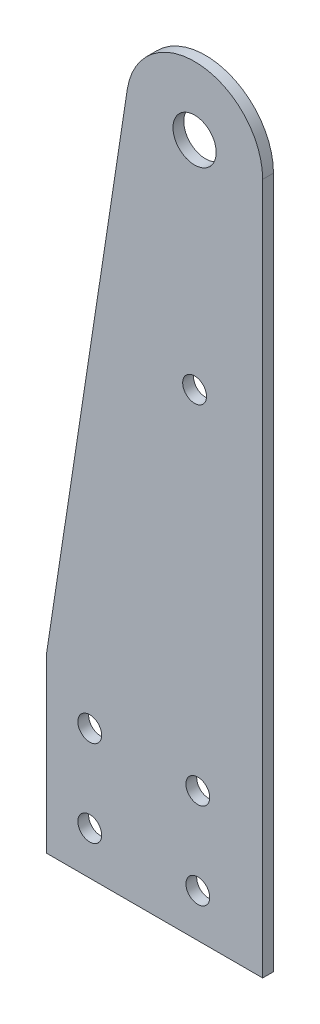
ISO-10303-21;
HEADER;
FILE_DESCRIPTION(('STEP AP214'),'2;1');
FILE_NAME('part.step','',(''),(''),'','','');
FILE_SCHEMA(('AUTOMOTIVE_DESIGN { 1 0 10303 214 1 1 1 1 }'));
ENDSEC;
DATA;
#1=APPLICATION_CONTEXT('core data for automotive mechanical design processes');
#2=APPLICATION_PROTOCOL_DEFINITION('international standard','automotive_design',2000,#1);
#3=PRODUCT_CONTEXT('',#1,'mechanical');
#4=PRODUCT('Part','Part','',(#3));
#5=PRODUCT_RELATED_PRODUCT_CATEGORY('part','',(#4));
#6=PRODUCT_DEFINITION_FORMATION('','',#4);
#7=PRODUCT_DEFINITION_CONTEXT('part definition',#1,'design');
#8=PRODUCT_DEFINITION('design','',#6,#7);
#9=PRODUCT_DEFINITION_SHAPE('','',#8);
#10=(LENGTH_UNIT() NAMED_UNIT(*) SI_UNIT(.MILLI.,.METRE.));
#11=(NAMED_UNIT(*) PLANE_ANGLE_UNIT() SI_UNIT($,.RADIAN.));
#12=(NAMED_UNIT(*) SI_UNIT($,.STERADIAN.) SOLID_ANGLE_UNIT());
#13=UNCERTAINTY_MEASURE_WITH_UNIT(LENGTH_MEASURE(1.E-05),#10,'distance_accuracy_value','');
#14=(GEOMETRIC_REPRESENTATION_CONTEXT(3) GLOBAL_UNCERTAINTY_ASSIGNED_CONTEXT((#13)) GLOBAL_UNIT_ASSIGNED_CONTEXT((#10,
#11,#12)) REPRESENTATION_CONTEXT('',''));
#15=CARTESIAN_POINT('',(0.,0.,0.));
#16=DIRECTION('',(0.,0.,1.));
#17=DIRECTION('',(1.,0.,0.));
#18=AXIS2_PLACEMENT_3D('',#15,#16,#17);
#19=CARTESIAN_POINT('',(11.75,177.8,3.175));
#20=DIRECTION('',(0.,0.,-1.));
#21=DIRECTION('',(-1.,0.,0.));
#22=AXIS2_PLACEMENT_3D('',#19,#20,#21);
#23=PLANE('',#22);
#24=DIRECTION('',(0.,-1.,0.));
#25=VECTOR('',#24,1.);
#26=CARTESIAN_POINT('',(-31.75,25.4,3.175));
#27=LINE('',#26,#25);
#28=CARTESIAN_POINT('',(-31.75,25.4,3.175));
#29=VERTEX_POINT('',#28);
#30=CARTESIAN_POINT('',(-31.75,-25.4,3.175));
#31=VERTEX_POINT('',#30);
#32=EDGE_CURVE('E125',#29,#31,#27,.T.);
#33=ORIENTED_EDGE('',*,*,#32,.T.);
#34=DIRECTION('',(1.,0.,0.));
#35=VECTOR('',#34,1.);
#36=CARTESIAN_POINT('',(-31.75,-25.4,3.175));
#37=LINE('',#36,#35);
#38=CARTESIAN_POINT('',(31.75,-25.4,3.175));
#39=VERTEX_POINT('',#38);
#40=EDGE_CURVE('E92',#31,#39,#37,.T.);
#41=ORIENTED_EDGE('',*,*,#40,.T.);
#42=DIRECTION('',(0.,1.,0.));
#43=VECTOR('',#42,1.);
#44=CARTESIAN_POINT('',(31.75,-25.4,3.175));
#45=LINE('',#44,#43);
#46=CARTESIAN_POINT('',(31.75,177.8,3.175));
#47=VERTEX_POINT('',#46);
#48=EDGE_CURVE('E96',#39,#47,#45,.T.);
#49=ORIENTED_EDGE('',*,*,#48,.T.);
#50=CARTESIAN_POINT('',(11.75,177.8,3.175));
#51=DIRECTION('',(0.,0.,1.));
#52=DIRECTION('',(-1.,0.,0.));
#53=AXIS2_PLACEMENT_3D('',#50,#51,#52);
#54=CIRCLE('',#53,20.);
#55=CARTESIAN_POINT('',(-8.02088998281772,180.818593925542,3.175));
#56=VERTEX_POINT('',#55);
#57=EDGE_CURVE('E100',#47,#56,#54,.T.);
#58=ORIENTED_EDGE('',*,*,#57,.T.);
#59=DIRECTION('',(-0.15092969627709,-0.988544499140886,0.));
#60=VECTOR('',#59,1.);
#61=CARTESIAN_POINT('',(-8.02088998281773,180.818593925542,3.175));
#62=LINE('',#61,#60);
#63=EDGE_CURVE('E58',#56,#29,#62,.T.);
#64=ORIENTED_EDGE('',*,*,#63,.T.);
#65=EDGE_LOOP('',(#33,#41,#49,#58,#64));
#66=FACE_BOUND('',#65,.T.);
#67=CARTESIAN_POINT('',(11.75,177.8,3.175));
#68=DIRECTION('',(0.,0.,1.));
#69=DIRECTION('',(1.,0.,0.));
#70=AXIS2_PLACEMENT_3D('',#67,#68,#69);
#71=CIRCLE('',#70,6.35);
#72=CARTESIAN_POINT('',(18.1,177.8,3.175));
#73=VERTEX_POINT('',#72);
#74=EDGE_CURVE('E120',#73,#73,#71,.T.);
#75=ORIENTED_EDGE('',*,*,#74,.F.);
#76=EDGE_LOOP('',(#75));
#77=FACE_BOUND('',#76,.T.);
#78=CARTESIAN_POINT('',(12.7,-12.7,3.175));
#79=DIRECTION('',(0.,0.,1.));
#80=DIRECTION('',(1.,0.,0.));
#81=AXIS2_PLACEMENT_3D('',#78,#79,#80);
#82=CIRCLE('',#81,3.5);
#83=CARTESIAN_POINT('',(16.2,-12.7,3.175));
#84=VERTEX_POINT('',#83);
#85=EDGE_CURVE('E204',#84,#84,#82,.T.);
#86=ORIENTED_EDGE('',*,*,#85,.F.);
#87=EDGE_LOOP('',(#86));
#88=FACE_BOUND('',#87,.T.);
#89=CARTESIAN_POINT('',(-19.05,12.7,3.175));
#90=DIRECTION('',(0.,0.,1.));
#91=DIRECTION('',(1.,0.,0.));
#92=AXIS2_PLACEMENT_3D('',#89,#90,#91);
#93=CIRCLE('',#92,3.5);
#94=CARTESIAN_POINT('',(-15.55,12.7,3.175));
#95=VERTEX_POINT('',#94);
#96=EDGE_CURVE('E198',#95,#95,#93,.T.);
#97=ORIENTED_EDGE('',*,*,#96,.F.);
#98=EDGE_LOOP('',(#97));
#99=FACE_BOUND('',#98,.T.);
#100=CARTESIAN_POINT('',(12.7,12.7,3.175));
#101=DIRECTION('',(0.,0.,1.));
#102=DIRECTION('',(1.,0.,0.));
#103=AXIS2_PLACEMENT_3D('',#100,#101,#102);
#104=CIRCLE('',#103,3.5);
#105=CARTESIAN_POINT('',(16.2,12.7,3.175));
#106=VERTEX_POINT('',#105);
#107=EDGE_CURVE('E192',#106,#106,#104,.T.);
#108=ORIENTED_EDGE('',*,*,#107,.F.);
#109=EDGE_LOOP('',(#108));
#110=FACE_BOUND('',#109,.T.);
#111=CARTESIAN_POINT('',(-19.05,-12.7,3.175));
#112=DIRECTION('',(0.,0.,1.));
#113=DIRECTION('',(1.,0.,0.));
#114=AXIS2_PLACEMENT_3D('',#111,#112,#113);
#115=CIRCLE('',#114,3.5);
#116=CARTESIAN_POINT('',(-15.55,-12.7,3.175));
#117=VERTEX_POINT('',#116);
#118=EDGE_CURVE('E186',#117,#117,#115,.T.);
#119=ORIENTED_EDGE('',*,*,#118,.F.);
#120=EDGE_LOOP('',(#119));
#121=FACE_BOUND('',#120,.T.);
#122=CARTESIAN_POINT('',(11.75,114.3,3.175));
#123=DIRECTION('',(0.,0.,1.));
#124=DIRECTION('',(1.,0.,0.));
#125=AXIS2_PLACEMENT_3D('',#122,#123,#124);
#126=CIRCLE('',#125,3.5);
#127=CARTESIAN_POINT('',(15.25,114.3,3.175));
#128=VERTEX_POINT('',#127);
#129=EDGE_CURVE('E177',#128,#128,#126,.T.);
#130=ORIENTED_EDGE('',*,*,#129,.F.);
#131=EDGE_LOOP('',(#130));
#132=FACE_BOUND('',#131,.T.);
#133=ADVANCED_FACE('F41',(#66,#77,#88,#99,#110,#121,#132),#23,.F.);
#134=CARTESIAN_POINT('',(11.75,177.8,0.));
#135=DIRECTION('',(0.,0.,-1.));
#136=DIRECTION('',(-1.,0.,0.));
#137=AXIS2_PLACEMENT_3D('',#134,#135,#136);
#138=PLANE('',#137);
#139=CARTESIAN_POINT('',(-19.05,-12.7,0.));
#140=DIRECTION('',(0.,0.,1.));
#141=DIRECTION('',(1.,0.,0.));
#142=AXIS2_PLACEMENT_3D('',#139,#140,#141);
#143=CIRCLE('',#142,3.5);
#144=CARTESIAN_POINT('',(-15.55,-12.7,0.));
#145=VERTEX_POINT('',#144);
#146=EDGE_CURVE('E183',#145,#145,#143,.T.);
#147=ORIENTED_EDGE('',*,*,#146,.T.);
#148=EDGE_LOOP('',(#147));
#149=FACE_BOUND('',#148,.T.);
#150=CARTESIAN_POINT('',(-19.05,12.7,0.));
#151=DIRECTION('',(0.,0.,1.));
#152=DIRECTION('',(1.,0.,0.));
#153=AXIS2_PLACEMENT_3D('',#150,#151,#152);
#154=CIRCLE('',#153,3.5);
#155=CARTESIAN_POINT('',(-15.55,12.7,0.));
#156=VERTEX_POINT('',#155);
#157=EDGE_CURVE('E195',#156,#156,#154,.T.);
#158=ORIENTED_EDGE('',*,*,#157,.T.);
#159=EDGE_LOOP('',(#158));
#160=FACE_BOUND('',#159,.T.);
#161=CARTESIAN_POINT('',(11.75,177.8,0.));
#162=DIRECTION('',(0.,0.,1.));
#163=DIRECTION('',(1.,0.,0.));
#164=AXIS2_PLACEMENT_3D('',#161,#162,#163);
#165=CIRCLE('',#164,6.35);
#166=CARTESIAN_POINT('',(18.1,177.8,0.));
#167=VERTEX_POINT('',#166);
#168=EDGE_CURVE('E207',#167,#167,#165,.T.);
#169=ORIENTED_EDGE('',*,*,#168,.T.);
#170=EDGE_LOOP('',(#169));
#171=FACE_BOUND('',#170,.T.);
#172=DIRECTION('',(0.,-1.,0.));
#173=VECTOR('',#172,1.);
#174=CARTESIAN_POINT('',(-31.75,25.4,0.));
#175=LINE('',#174,#173);
#176=CARTESIAN_POINT('',(-31.75,25.4,0.));
#177=VERTEX_POINT('',#176);
#178=CARTESIAN_POINT('',(-31.75,-25.4,0.));
#179=VERTEX_POINT('',#178);
#180=EDGE_CURVE('E116',#177,#179,#175,.T.);
#181=ORIENTED_EDGE('',*,*,#180,.F.);
#182=DIRECTION('',(-0.15092969627709,-0.988544499140886,0.));
#183=VECTOR('',#182,1.);
#184=CARTESIAN_POINT('',(-8.02088998281773,180.818593925542,0.));
#185=LINE('',#184,#183);
#186=CARTESIAN_POINT('',(-8.02088998281772,180.818593925542,0.));
#187=VERTEX_POINT('',#186);
#188=EDGE_CURVE('E84',#187,#177,#185,.T.);
#189=ORIENTED_EDGE('',*,*,#188,.F.);
#190=CARTESIAN_POINT('',(11.75,177.8,0.));
#191=DIRECTION('',(0.,0.,1.));
#192=DIRECTION('',(-1.,0.,0.));
#193=AXIS2_PLACEMENT_3D('',#190,#191,#192);
#194=CIRCLE('',#193,20.);
#195=CARTESIAN_POINT('',(31.75,177.8,0.));
#196=VERTEX_POINT('',#195);
#197=EDGE_CURVE('E78',#196,#187,#194,.T.);
#198=ORIENTED_EDGE('',*,*,#197,.F.);
#199=DIRECTION('',(0.,1.,0.));
#200=VECTOR('',#199,1.);
#201=CARTESIAN_POINT('',(31.75,-25.4,0.));
#202=LINE('',#201,#200);
#203=CARTESIAN_POINT('',(31.75,-25.4,0.));
#204=VERTEX_POINT('',#203);
#205=EDGE_CURVE('E107',#204,#196,#202,.T.);
#206=ORIENTED_EDGE('',*,*,#205,.F.);
#207=DIRECTION('',(1.,0.,0.));
#208=VECTOR('',#207,1.);
#209=CARTESIAN_POINT('',(-31.75,-25.4,0.));
#210=LINE('',#209,#208);
#211=EDGE_CURVE('E119',#179,#204,#210,.T.);
#212=ORIENTED_EDGE('',*,*,#211,.F.);
#213=EDGE_LOOP('',(#181,#189,#198,#206,#212));
#214=FACE_BOUND('',#213,.T.);
#215=CARTESIAN_POINT('',(12.7,-12.7,0.));
#216=DIRECTION('',(0.,0.,1.));
#217=DIRECTION('',(1.,0.,0.));
#218=AXIS2_PLACEMENT_3D('',#215,#216,#217);
#219=CIRCLE('',#218,3.5);
#220=CARTESIAN_POINT('',(16.2,-12.7,0.));
#221=VERTEX_POINT('',#220);
#222=EDGE_CURVE('E201',#221,#221,#219,.T.);
#223=ORIENTED_EDGE('',*,*,#222,.T.);
#224=EDGE_LOOP('',(#223));
#225=FACE_BOUND('',#224,.T.);
#226=CARTESIAN_POINT('',(12.7,12.7,0.));
#227=DIRECTION('',(0.,0.,1.));
#228=DIRECTION('',(1.,0.,0.));
#229=AXIS2_PLACEMENT_3D('',#226,#227,#228);
#230=CIRCLE('',#229,3.5);
#231=CARTESIAN_POINT('',(16.2,12.7,0.));
#232=VERTEX_POINT('',#231);
#233=EDGE_CURVE('E189',#232,#232,#230,.T.);
#234=ORIENTED_EDGE('',*,*,#233,.T.);
#235=EDGE_LOOP('',(#234));
#236=FACE_BOUND('',#235,.T.);
#237=CARTESIAN_POINT('',(11.75,114.3,0.));
#238=DIRECTION('',(0.,0.,1.));
#239=DIRECTION('',(1.,0.,0.));
#240=AXIS2_PLACEMENT_3D('',#237,#238,#239);
#241=CIRCLE('',#240,3.5);
#242=CARTESIAN_POINT('',(15.25,114.3,0.));
#243=VERTEX_POINT('',#242);
#244=EDGE_CURVE('E180',#243,#243,#241,.T.);
#245=ORIENTED_EDGE('',*,*,#244,.T.);
#246=EDGE_LOOP('',(#245));
#247=FACE_BOUND('',#246,.T.);
#248=ADVANCED_FACE('F129',(#149,#160,#171,#214,#225,#236,#247),#138,.T.);
#249=CARTESIAN_POINT('',(-31.75,25.4,3.175));
#250=DIRECTION('',(1.,0.,0.));
#251=DIRECTION('',(0.,0.,-1.));
#252=AXIS2_PLACEMENT_3D('',#249,#250,#251);
#253=PLANE('',#252);
#254=ORIENTED_EDGE('',*,*,#180,.T.);
#255=DIRECTION('',(0.,0.,-1.));
#256=VECTOR('',#255,1.);
#257=CARTESIAN_POINT('',(-31.75,-25.4,3.175));
#258=LINE('',#257,#256);
#259=EDGE_CURVE('E11',#31,#179,#258,.T.);
#260=ORIENTED_EDGE('',*,*,#259,.F.);
#261=ORIENTED_EDGE('',*,*,#32,.F.);
#262=DIRECTION('',(0.,0.,-1.));
#263=VECTOR('',#262,1.);
#264=CARTESIAN_POINT('',(-31.75,25.4,3.175));
#265=LINE('',#264,#263);
#266=EDGE_CURVE('E112',#29,#177,#265,.T.);
#267=ORIENTED_EDGE('',*,*,#266,.T.);
#268=EDGE_LOOP('',(#254,#260,#261,#267));
#269=FACE_BOUND('',#268,.T.);
#270=ADVANCED_FACE('F43',(#269),#253,.F.);
#271=CARTESIAN_POINT('',(-31.75,-25.4,3.175));
#272=DIRECTION('',(0.,1.,0.));
#273=DIRECTION('',(0.,0.,1.));
#274=AXIS2_PLACEMENT_3D('',#271,#272,#273);
#275=PLANE('',#274);
#276=ORIENTED_EDGE('',*,*,#211,.T.);
#277=DIRECTION('',(0.,0.,-1.));
#278=VECTOR('',#277,1.);
#279=CARTESIAN_POINT('',(31.75,-25.4,3.175));
#280=LINE('',#279,#278);
#281=EDGE_CURVE('E50',#39,#204,#280,.T.);
#282=ORIENTED_EDGE('',*,*,#281,.F.);
#283=ORIENTED_EDGE('',*,*,#40,.F.);
#284=ORIENTED_EDGE('',*,*,#259,.T.);
#285=EDGE_LOOP('',(#276,#282,#283,#284));
#286=FACE_BOUND('',#285,.T.);
#287=ADVANCED_FACE('F282',(#286),#275,.F.);
#288=CARTESIAN_POINT('',(31.75,-25.4,3.175));
#289=DIRECTION('',(-1.,0.,0.));
#290=DIRECTION('',(0.,0.,1.));
#291=AXIS2_PLACEMENT_3D('',#288,#289,#290);
#292=PLANE('',#291);
#293=ORIENTED_EDGE('',*,*,#205,.T.);
#294=DIRECTION('',(0.,0.,-1.));
#295=VECTOR('',#294,1.);
#296=CARTESIAN_POINT('',(31.75,177.8,3.175));
#297=LINE('',#296,#295);
#298=EDGE_CURVE('E104',#47,#196,#297,.T.);
#299=ORIENTED_EDGE('',*,*,#298,.F.);
#300=ORIENTED_EDGE('',*,*,#48,.F.);
#301=ORIENTED_EDGE('',*,*,#281,.T.);
#302=EDGE_LOOP('',(#293,#299,#300,#301));
#303=FACE_BOUND('',#302,.T.);
#304=ADVANCED_FACE('F105',(#303),#292,.F.);
#305=CARTESIAN_POINT('',(11.75,177.8,3.175));
#306=DIRECTION('',(0.,0.,-1.));
#307=DIRECTION('',(-1.,0.,0.));
#308=AXIS2_PLACEMENT_3D('',#305,#306,#307);
#309=CYLINDRICAL_SURFACE('',#308,20.);
#310=ORIENTED_EDGE('',*,*,#197,.T.);
#311=DIRECTION('',(0.,0.,-1.));
#312=VECTOR('',#311,1.);
#313=CARTESIAN_POINT('',(-8.02088998281772,180.818593925542,3.175));
#314=LINE('',#313,#312);
#315=EDGE_CURVE('E108',#56,#187,#314,.T.);
#316=ORIENTED_EDGE('',*,*,#315,.F.);
#317=ORIENTED_EDGE('',*,*,#57,.F.);
#318=ORIENTED_EDGE('',*,*,#298,.T.);
#319=EDGE_LOOP('',(#310,#316,#317,#318));
#320=FACE_BOUND('',#319,.T.);
#321=ADVANCED_FACE('F110',(#320),#309,.T.);
#322=CARTESIAN_POINT('',(-8.02088998281773,180.818593925542,3.175));
#323=DIRECTION('',(0.988544499140886,-0.15092969627709,0.));
#324=DIRECTION('',(0.15092969627709,0.988544499140886,0.));
#325=AXIS2_PLACEMENT_3D('',#322,#323,#324);
#326=PLANE('',#325);
#327=ORIENTED_EDGE('',*,*,#188,.T.);
#328=ORIENTED_EDGE('',*,*,#266,.F.);
#329=ORIENTED_EDGE('',*,*,#63,.F.);
#330=ORIENTED_EDGE('',*,*,#315,.T.);
#331=EDGE_LOOP('',(#327,#328,#329,#330));
#332=FACE_BOUND('',#331,.T.);
#333=ADVANCED_FACE('F134',(#332),#326,.F.);
#334=CARTESIAN_POINT('',(11.75,177.8,3.175));
#335=DIRECTION('',(0.,0.,-1.));
#336=DIRECTION('',(-1.,0.,0.));
#337=AXIS2_PLACEMENT_3D('',#334,#335,#336);
#338=CYLINDRICAL_SURFACE('',#337,6.35);
#339=ORIENTED_EDGE('',*,*,#74,.T.);
#340=EDGE_LOOP('',(#339));
#341=FACE_BOUND('',#340,.T.);
#342=ORIENTED_EDGE('',*,*,#168,.F.);
#343=EDGE_LOOP('',(#342));
#344=FACE_BOUND('',#343,.T.);
#345=ADVANCED_FACE('F136',(#341,#344),#338,.F.);
#346=CARTESIAN_POINT('',(12.7,-12.7,3.175));
#347=DIRECTION('',(0.,0.,-1.));
#348=DIRECTION('',(-1.,0.,0.));
#349=AXIS2_PLACEMENT_3D('',#346,#347,#348);
#350=CYLINDRICAL_SURFACE('',#349,3.5);
#351=ORIENTED_EDGE('',*,*,#85,.T.);
#352=EDGE_LOOP('',(#351));
#353=FACE_BOUND('',#352,.T.);
#354=ORIENTED_EDGE('',*,*,#222,.F.);
#355=EDGE_LOOP('',(#354));
#356=FACE_BOUND('',#355,.T.);
#357=ADVANCED_FACE('F142',(#353,#356),#350,.F.);
#358=CARTESIAN_POINT('',(-19.05,12.7,3.175));
#359=DIRECTION('',(0.,0.,-1.));
#360=DIRECTION('',(-1.,0.,0.));
#361=AXIS2_PLACEMENT_3D('',#358,#359,#360);
#362=CYLINDRICAL_SURFACE('',#361,3.5);
#363=ORIENTED_EDGE('',*,*,#96,.T.);
#364=EDGE_LOOP('',(#363));
#365=FACE_BOUND('',#364,.T.);
#366=ORIENTED_EDGE('',*,*,#157,.F.);
#367=EDGE_LOOP('',(#366));
#368=FACE_BOUND('',#367,.T.);
#369=ADVANCED_FACE('F156',(#365,#368),#362,.F.);
#370=CARTESIAN_POINT('',(12.7,12.7,3.175));
#371=DIRECTION('',(0.,0.,-1.));
#372=DIRECTION('',(-1.,0.,0.));
#373=AXIS2_PLACEMENT_3D('',#370,#371,#372);
#374=CYLINDRICAL_SURFACE('',#373,3.5);
#375=ORIENTED_EDGE('',*,*,#107,.T.);
#376=EDGE_LOOP('',(#375));
#377=FACE_BOUND('',#376,.T.);
#378=ORIENTED_EDGE('',*,*,#233,.F.);
#379=EDGE_LOOP('',(#378));
#380=FACE_BOUND('',#379,.T.);
#381=ADVANCED_FACE('F160',(#377,#380),#374,.F.);
#382=CARTESIAN_POINT('',(-19.05,-12.7,3.175));
#383=DIRECTION('',(0.,0.,-1.));
#384=DIRECTION('',(-1.,0.,0.));
#385=AXIS2_PLACEMENT_3D('',#382,#383,#384);
#386=CYLINDRICAL_SURFACE('',#385,3.5);
#387=ORIENTED_EDGE('',*,*,#118,.T.);
#388=EDGE_LOOP('',(#387));
#389=FACE_BOUND('',#388,.T.);
#390=ORIENTED_EDGE('',*,*,#146,.F.);
#391=EDGE_LOOP('',(#390));
#392=FACE_BOUND('',#391,.T.);
#393=ADVANCED_FACE('F164',(#389,#392),#386,.F.);
#394=CARTESIAN_POINT('',(11.75,114.3,3.175));
#395=DIRECTION('',(0.,0.,-1.));
#396=DIRECTION('',(-1.,0.,0.));
#397=AXIS2_PLACEMENT_3D('',#394,#395,#396);
#398=CYLINDRICAL_SURFACE('',#397,3.5);
#399=ORIENTED_EDGE('',*,*,#129,.T.);
#400=EDGE_LOOP('',(#399));
#401=FACE_BOUND('',#400,.T.);
#402=ORIENTED_EDGE('',*,*,#244,.F.);
#403=EDGE_LOOP('',(#402));
#404=FACE_BOUND('',#403,.T.);
#405=ADVANCED_FACE('F168',(#401,#404),#398,.F.);
#406=CLOSED_SHELL('',(#133,#248,#270,#287,#304,#321,#333,#345,#357,#369,#381,#393,#405));
#407=MANIFOLD_SOLID_BREP('B2',#406);
#408=ADVANCED_BREP_SHAPE_REPRESENTATION('',(#18,#407),#14);
#409=SHAPE_DEFINITION_REPRESENTATION(#9,#408);
ENDSEC;
END-ISO-10303-21;
